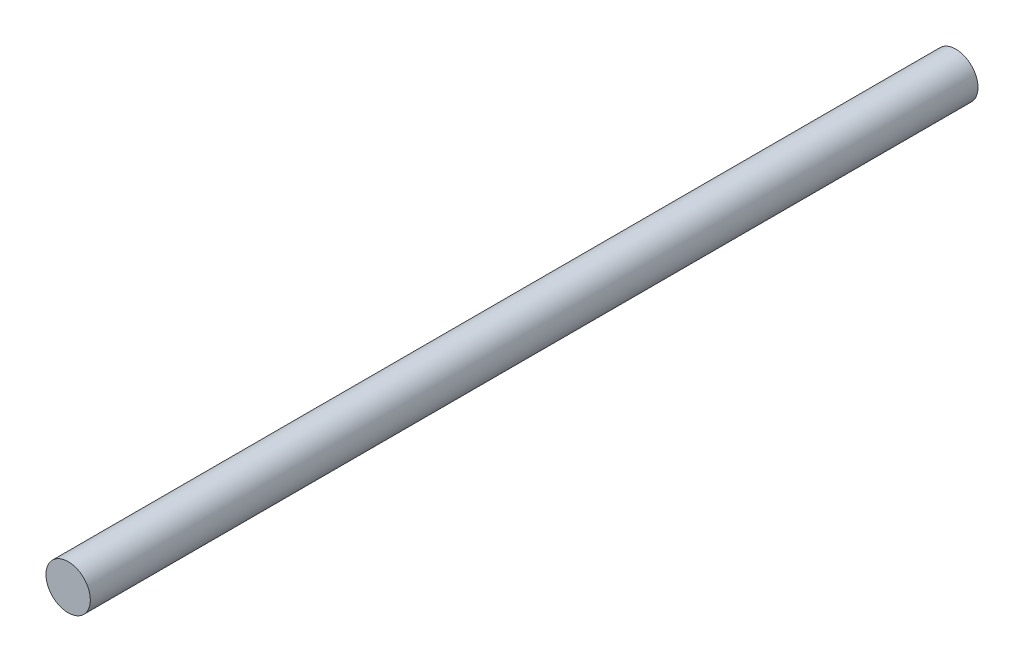
ISO-10303-21;
HEADER;
FILE_DESCRIPTION(('STEP AP214'),'2;1');
FILE_NAME('part.step','',(''),(''),'','','');
FILE_SCHEMA(('AUTOMOTIVE_DESIGN { 1 0 10303 214 1 1 1 1 }'));
ENDSEC;
DATA;
#1=APPLICATION_CONTEXT('core data for automotive mechanical design processes');
#2=APPLICATION_PROTOCOL_DEFINITION('international standard','automotive_design',2000,#1);
#3=PRODUCT_CONTEXT('',#1,'mechanical');
#4=PRODUCT('Part','Part','',(#3));
#5=PRODUCT_RELATED_PRODUCT_CATEGORY('part','',(#4));
#6=PRODUCT_DEFINITION_FORMATION('','',#4);
#7=PRODUCT_DEFINITION_CONTEXT('part definition',#1,'design');
#8=PRODUCT_DEFINITION('design','',#6,#7);
#9=PRODUCT_DEFINITION_SHAPE('','',#8);
#10=(LENGTH_UNIT() NAMED_UNIT(*) SI_UNIT(.MILLI.,.METRE.));
#11=(NAMED_UNIT(*) PLANE_ANGLE_UNIT() SI_UNIT($,.RADIAN.));
#12=(NAMED_UNIT(*) SI_UNIT($,.STERADIAN.) SOLID_ANGLE_UNIT());
#13=UNCERTAINTY_MEASURE_WITH_UNIT(LENGTH_MEASURE(1.E-05),#10,'distance_accuracy_value','');
#14=(GEOMETRIC_REPRESENTATION_CONTEXT(3) GLOBAL_UNCERTAINTY_ASSIGNED_CONTEXT((#13)) GLOBAL_UNIT_ASSIGNED_CONTEXT((#10,
#11,#12)) REPRESENTATION_CONTEXT('',''));
#15=CARTESIAN_POINT('',(0.,0.,0.));
#16=DIRECTION('',(0.,0.,1.));
#17=DIRECTION('',(1.,0.,0.));
#18=AXIS2_PLACEMENT_3D('',#15,#16,#17);
#19=CARTESIAN_POINT('',(0.,0.,80.));
#20=DIRECTION('',(0.,0.,-1.));
#21=DIRECTION('',(-1.,0.,0.));
#22=AXIS2_PLACEMENT_3D('',#19,#20,#21);
#23=CYLINDRICAL_SURFACE('',#22,2.);
#24=CARTESIAN_POINT('',(0.,0.,80.));
#25=DIRECTION('',(0.,0.,1.));
#26=DIRECTION('',(1.,0.,0.));
#27=AXIS2_PLACEMENT_3D('',#24,#25,#26);
#28=CIRCLE('',#27,2.);
#29=CARTESIAN_POINT('',(2.,0.,80.));
#30=VERTEX_POINT('',#29);
#31=EDGE_CURVE('E10',#30,#30,#28,.T.);
#32=ORIENTED_EDGE('',*,*,#31,.F.);
#33=EDGE_LOOP('',(#32));
#34=FACE_BOUND('',#33,.T.);
#35=CARTESIAN_POINT('',(0.,0.,0.));
#36=DIRECTION('',(0.,0.,1.));
#37=DIRECTION('',(1.,0.,0.));
#38=AXIS2_PLACEMENT_3D('',#35,#36,#37);
#39=CIRCLE('',#38,2.);
#40=CARTESIAN_POINT('',(2.,0.,0.));
#41=VERTEX_POINT('',#40);
#42=EDGE_CURVE('E34',#41,#41,#39,.T.);
#43=ORIENTED_EDGE('',*,*,#42,.T.);
#44=EDGE_LOOP('',(#43));
#45=FACE_BOUND('',#44,.T.);
#46=ADVANCED_FACE('F31',(#34,#45),#23,.T.);
#47=CARTESIAN_POINT('',(0.,0.,80.));
#48=DIRECTION('',(0.,0.,1.));
#49=DIRECTION('',(1.,0.,0.));
#50=AXIS2_PLACEMENT_3D('',#47,#48,#49);
#51=PLANE('',#50);
#52=ORIENTED_EDGE('',*,*,#31,.T.);
#53=EDGE_LOOP('',(#52));
#54=FACE_BOUND('',#53,.T.);
#55=ADVANCED_FACE('F46',(#54),#51,.T.);
#56=CARTESIAN_POINT('',(0.,0.,0.));
#57=DIRECTION('',(0.,0.,1.));
#58=DIRECTION('',(1.,0.,0.));
#59=AXIS2_PLACEMENT_3D('',#56,#57,#58);
#60=PLANE('',#59);
#61=ORIENTED_EDGE('',*,*,#42,.F.);
#62=EDGE_LOOP('',(#61));
#63=FACE_BOUND('',#62,.T.);
#64=ADVANCED_FACE('F44',(#63),#60,.F.);
#65=CLOSED_SHELL('',(#46,#55,#64));
#66=MANIFOLD_SOLID_BREP('B2',#65);
#67=ADVANCED_BREP_SHAPE_REPRESENTATION('',(#18,#66),#14);
#68=SHAPE_DEFINITION_REPRESENTATION(#9,#67);
ENDSEC;
END-ISO-10303-21;
